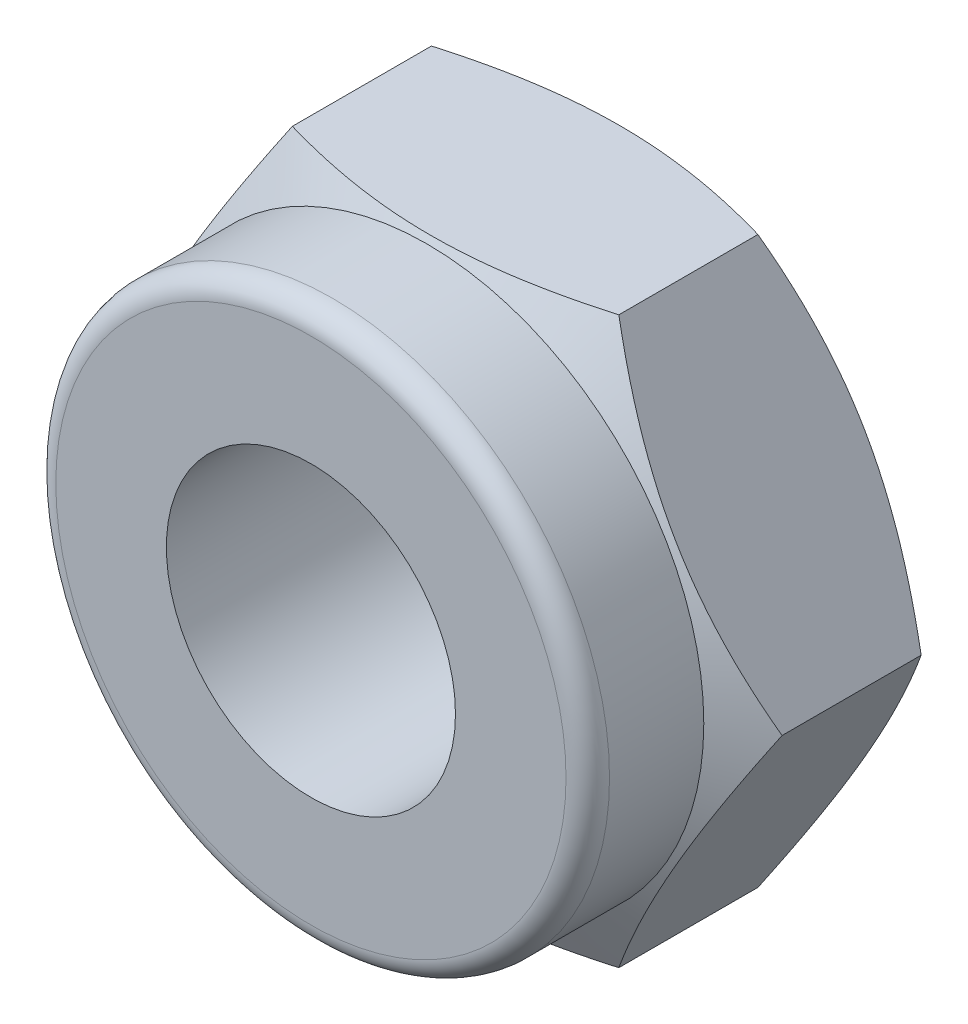
ISO-10303-21;
HEADER;
FILE_DESCRIPTION(('STEP AP214'),'2;1');
FILE_NAME('part.step','',(''),(''),'','','');
FILE_SCHEMA(('AUTOMOTIVE_DESIGN { 1 0 10303 214 1 1 1 1 }'));
ENDSEC;
DATA;
#1=APPLICATION_CONTEXT('core data for automotive mechanical design processes');
#2=APPLICATION_PROTOCOL_DEFINITION('international standard','automotive_design',2000,#1);
#3=PRODUCT_CONTEXT('',#1,'mechanical');
#4=PRODUCT('Part','Part','',(#3));
#5=PRODUCT_RELATED_PRODUCT_CATEGORY('part','',(#4));
#6=PRODUCT_DEFINITION_FORMATION('','',#4);
#7=PRODUCT_DEFINITION_CONTEXT('part definition',#1,'design');
#8=PRODUCT_DEFINITION('design','',#6,#7);
#9=PRODUCT_DEFINITION_SHAPE('','',#8);
#10=(LENGTH_UNIT() NAMED_UNIT(*) SI_UNIT(.MILLI.,.METRE.));
#11=(NAMED_UNIT(*) PLANE_ANGLE_UNIT() SI_UNIT($,.RADIAN.));
#12=(NAMED_UNIT(*) SI_UNIT($,.STERADIAN.) SOLID_ANGLE_UNIT());
#13=UNCERTAINTY_MEASURE_WITH_UNIT(LENGTH_MEASURE(1.E-05),#10,'distance_accuracy_value','');
#14=(GEOMETRIC_REPRESENTATION_CONTEXT(3) GLOBAL_UNCERTAINTY_ASSIGNED_CONTEXT((#13)) GLOBAL_UNIT_ASSIGNED_CONTEXT((#10,
#11,#12)) REPRESENTATION_CONTEXT('',''));
#15=CARTESIAN_POINT('',(0.,0.,0.));
#16=DIRECTION('',(0.,0.,1.));
#17=DIRECTION('',(1.,0.,0.));
#18=AXIS2_PLACEMENT_3D('',#15,#16,#17);
#19=CARTESIAN_POINT('',(0.,0.,4.35));
#20=DIRECTION('',(0.,0.,-1.));
#21=DIRECTION('',(-1.,0.,0.));
#22=AXIS2_PLACEMENT_3D('',#19,#20,#21);
#23=CYLINDRICAL_SURFACE('',#22,6.365);
#24=CARTESIAN_POINT('',(0.,0.,1.85));
#25=DIRECTION('',(0.,0.,1.));
#26=DIRECTION('',(1.,0.,0.));
#27=AXIS2_PLACEMENT_3D('',#24,#25,#26);
#28=CIRCLE('',#27,6.365);
#29=CARTESIAN_POINT('',(6.365,0.,1.85));
#30=VERTEX_POINT('',#29);
#31=EDGE_CURVE('E195',#30,#30,#28,.T.);
#32=ORIENTED_EDGE('',*,*,#31,.F.);
#33=EDGE_LOOP('',(#32));
#34=FACE_BOUND('',#33,.T.);
#35=CARTESIAN_POINT('',(0.,0.,-0.317542648054294));
#36=DIRECTION('',(0.,0.,-1.));
#37=DIRECTION('',(1.,0.,0.));
#38=AXIS2_PLACEMENT_3D('',#35,#36,#37);
#39=CIRCLE('',#38,6.365);
#40=CARTESIAN_POINT('',(6.365,0.,-0.317542648054294));
#41=VERTEX_POINT('',#40);
#42=EDGE_CURVE('E198',#41,#41,#39,.T.);
#43=ORIENTED_EDGE('',*,*,#42,.F.);
#44=EDGE_LOOP('',(#43));
#45=FACE_BOUND('',#44,.T.);
#46=ADVANCED_FACE('F17',(#34,#45),#23,.T.);
#47=CARTESIAN_POINT('',(0.,0.,1.85));
#48=DIRECTION('',(0.,0.,1.));
#49=DIRECTION('',(1.,0.,0.));
#50=AXIS2_PLACEMENT_3D('',#47,#48,#49);
#51=TOROIDAL_SURFACE('',#50,5.865,0.5);
#52=ORIENTED_EDGE('',*,*,#31,.T.);
#53=EDGE_LOOP('',(#52));
#54=FACE_BOUND('',#53,.T.);
#55=CARTESIAN_POINT('',(0.,0.,2.35));
#56=DIRECTION('',(0.,0.,-1.));
#57=DIRECTION('',(1.,0.,0.));
#58=AXIS2_PLACEMENT_3D('',#55,#56,#57);
#59=CIRCLE('',#58,5.865);
#60=CARTESIAN_POINT('',(-5.865,0.,2.35));
#61=VERTEX_POINT('',#60);
#62=CARTESIAN_POINT('',(5.865,0.,2.35));
#63=VERTEX_POINT('',#62);
#64=EDGE_CURVE('E75',#61,#63,#59,.F.);
#65=ORIENTED_EDGE('',*,*,#64,.F.);
#66=CARTESIAN_POINT('',(0.,0.,2.35));
#67=DIRECTION('',(0.,0.,-1.));
#68=DIRECTION('',(-1.,0.,0.));
#69=AXIS2_PLACEMENT_3D('',#66,#67,#68);
#70=CIRCLE('',#69,5.865);
#71=EDGE_CURVE('E201',#63,#61,#70,.F.);
#72=ORIENTED_EDGE('',*,*,#71,.F.);
#73=EDGE_LOOP('',(#65,#72));
#74=FACE_BOUND('',#73,.T.);
#75=ADVANCED_FACE('F110',(#54,#74),#51,.T.);
#76=CARTESIAN_POINT('',(0.,0.,-0.97999251121531));
#77=DIRECTION('',(0.,0.,-1.));
#78=DIRECTION('',(-1.,0.,0.));
#79=AXIS2_PLACEMENT_3D('',#76,#77,#78);
#80=CONICAL_SURFACE('',#79,7.51239682046193,1.0471975511966);
#81=CARTESIAN_POINT('',(7.50555349946514,0.,-0.976041517995662));
#82=CARTESIAN_POINT('',(7.42306413225731,-0.142875775088176,-0.928425447547227));
#83=CARTESIAN_POINT('',(7.34026720585395,-0.286284258329331,-0.882970550055043));
#84=CARTESIAN_POINT('',(7.17400096468323,-0.574265835620523,-0.796978304075957));
#85=CARTESIAN_POINT('',(7.09053137629194,-0.718839403601101,-0.756443076940983));
#86=CARTESIAN_POINT('',(6.83878625276799,-1.15487474810228,-0.643012619628592));
#87=CARTESIAN_POINT('',(6.66951702604567,-1.44805764894324,-0.578495682867198));
#88=CARTESIAN_POINT('',(6.41620872846852,-1.88680049032564,-0.502843782974544));
#89=CARTESIAN_POINT('',(6.33292644227507,-2.03104964138317,-0.48129310542054));
#90=CARTESIAN_POINT('',(6.16598561364301,-2.32019963843156,-0.445156633633839));
#91=CARTESIAN_POINT('',(6.08232710510691,-2.46510042570152,-0.430570224040223));
#92=CARTESIAN_POINT('',(5.91486483881928,-2.75515357926232,-0.408734025939752));
#93=CARTESIAN_POINT('',(5.83106135447214,-2.90030547200287,-0.401475912268133));
#94=CARTESIAN_POINT('',(5.66338165892069,-3.19073522409566,-0.394444145267347));
#95=CARTESIAN_POINT('',(5.57950545004408,-3.33601307941621,-0.394670260634795));
#96=CARTESIAN_POINT('',(5.34972638911939,-3.73400208745323,-0.405576488157031));
#97=CARTESIAN_POINT('',(5.20389879784904,-3.98658288467888,-0.423875958247116));
#98=CARTESIAN_POINT('',(4.91321216353889,-4.49006690438526,-0.481897477157326));
#99=CARTESIAN_POINT('',(4.76835414237743,-4.74096835692078,-0.521639346886367));
#100=CARTESIAN_POINT('',(4.47708276744823,-5.24546517708861,-0.620980029139186));
#101=CARTESIAN_POINT('',(4.33070615631823,-5.49899690460551,-0.680999630839513));
#102=CARTESIAN_POINT('',(4.04013550251678,-6.00228004017814,-0.817218966611441));
#103=CARTESIAN_POINT('',(3.89593774018532,-6.25203789087397,-0.893386714735364));
#104=CARTESIAN_POINT('',(3.75277674973258,-6.5,-0.976041517995661));
#105=B_SPLINE_CURVE_WITH_KNOTS('',3,(#81,#82,#83,#84,#85,#86,#87,#88,#89,#90,#91,#92,#93,#94,
#95,#96,#97,#98,#99,#100,#101,#102,#103,#104),.UNSPECIFIED.,.F.,.F.,(4,2,2,2,2,2,2,2,2,2,2,4),
(0.,0.515097151807923,1.03041562924707,2.0631934970254,2.56693469263121,3.07063136955385,
3.57375518587235,4.07686345294286,4.95263085757859,5.82920919385675,6.72522583711309,
7.61948397794854),.UNSPECIFIED.);
#106=CARTESIAN_POINT('',(7.50555349946513,0.,-0.976041517995657));
#107=VERTEX_POINT('',#106);
#108=CARTESIAN_POINT('',(3.75277674973258,-6.5,-0.976041517995662));
#109=VERTEX_POINT('',#108);
#110=EDGE_CURVE('E64',#107,#109,#105,.T.);
#111=ORIENTED_EDGE('',*,*,#110,.F.);
#112=CARTESIAN_POINT('',(3.75277674973256,6.5,-0.976041517995656));
#113=CARTESIAN_POINT('',(3.83526611694039,6.35712422491183,-0.928425447547222));
#114=CARTESIAN_POINT('',(3.91806304334374,6.21371574167068,-0.882970550055038));
#115=CARTESIAN_POINT('',(4.08432928451447,5.92573416437948,-0.796978304075951));
#116=CARTESIAN_POINT('',(4.16779887290576,5.78116059639891,-0.756443076940976));
#117=CARTESIAN_POINT('',(4.4195439964297,5.34512525189773,-0.643012619628585));
#118=CARTESIAN_POINT('',(4.58881322315202,5.05194235105677,-0.57849568286719));
#119=CARTESIAN_POINT('',(4.84212152072918,4.61319950967437,-0.502843782974536));
#120=CARTESIAN_POINT('',(4.92540380692262,4.46895035861684,-0.481293105420532));
#121=CARTESIAN_POINT('',(5.09234463555468,4.17980036156845,-0.445156633633831));
#122=CARTESIAN_POINT('',(5.17600314409078,4.03489957429849,-0.430570224040214));
#123=CARTESIAN_POINT('',(5.34346541037841,3.74484642073769,-0.408734025939743));
#124=CARTESIAN_POINT('',(5.42726889472555,3.59969452799714,-0.401475912268124));
#125=CARTESIAN_POINT('',(5.594948590277,3.30926477590435,-0.394444145267338));
#126=CARTESIAN_POINT('',(5.67882479915361,3.16398692058381,-0.394670260634785));
#127=CARTESIAN_POINT('',(5.9086038600783,2.76599791254678,-0.40557648815702));
#128=CARTESIAN_POINT('',(6.05443145134866,2.51341711532113,-0.423875958247104));
#129=CARTESIAN_POINT('',(6.34511808565881,2.00993309561475,-0.481897477157315));
#130=CARTESIAN_POINT('',(6.48997610682026,1.75903164307923,-0.521639346886356));
#131=CARTESIAN_POINT('',(6.78124748174947,1.25453482291139,-0.620980029139175));
#132=CARTESIAN_POINT('',(6.92762409287947,1.00100309539449,-0.680999630839503));
#133=CARTESIAN_POINT('',(7.21819474668093,0.497719959821852,-0.817218966611432));
#134=CARTESIAN_POINT('',(7.36239250901238,0.247962109126026,-0.893386714735356));
#135=CARTESIAN_POINT('',(7.50555349946513,0.,-0.976041517995654));
#136=B_SPLINE_CURVE_WITH_KNOTS('',3,(#112,#113,#114,#115,#116,#117,#118,#119,#120,#121,#122,
#123,#124,#125,#126,#127,#128,#129,#130,#131,#132,#133,#134,#135),.UNSPECIFIED.,.F.,.F.,(4,2,2,
2,2,2,2,2,2,2,2,4),(0.,0.515097151807923,1.03041562924707,2.06319349702539,2.5669346926312,
3.07063136955385,3.57375518587234,4.07686345294285,4.95263085757859,5.82920919385676,
6.72522583711311,7.61948397794856),.UNSPECIFIED.);
#137=CARTESIAN_POINT('',(3.75277674973256,6.5,-0.976041517995657));
#138=VERTEX_POINT('',#137);
#139=EDGE_CURVE('E69',#138,#107,#136,.T.);
#140=ORIENTED_EDGE('',*,*,#139,.F.);
#141=CARTESIAN_POINT('',(-3.75277674973256,6.5,-0.976041517995659));
#142=CARTESIAN_POINT('',(-3.5877980153169,6.5,-0.928425447547224));
#143=CARTESIAN_POINT('',(-3.42220416251019,6.5,-0.882970550055041));
#144=CARTESIAN_POINT('',(-3.08967168016874,6.5,-0.796978304075955));
#145=CARTESIAN_POINT('',(-2.92273250338616,6.5,-0.75644307694098));
#146=CARTESIAN_POINT('',(-2.41924225633827,6.5,-0.64301261962859));
#147=CARTESIAN_POINT('',(-2.08070380289362,6.5,-0.578495682867194));
#148=CARTESIAN_POINT('',(-1.57408720773932,6.5,-0.502843782974541));
#149=CARTESIAN_POINT('',(-1.40752263535244,6.5,-0.481293105420537));
#150=CARTESIAN_POINT('',(-1.07364097808831,6.5,-0.445156633633837));
#151=CARTESIAN_POINT('',(-0.906323961016103,6.5,-0.43057022404022));
#152=CARTESIAN_POINT('',(-0.57139942844085,6.5,-0.408734025939749));
#153=CARTESIAN_POINT('',(-0.40379245974657,6.5,-0.40147591226813));
#154=CARTESIAN_POINT('',(-0.0684330686436741,6.5,-0.394444145267344));
#155=CARTESIAN_POINT('',(0.0993193491095459,6.5,-0.394670260634792));
#156=CARTESIAN_POINT('',(0.558877470958923,6.5,-0.405576488157028));
#157=CARTESIAN_POINT('',(0.850532653499638,6.5,-0.423875958247112));
#158=CARTESIAN_POINT('',(1.43190592211994,6.5,-0.481897477157322));
#159=CARTESIAN_POINT('',(1.72162196444284,6.5,-0.521639346886363));
#160=CARTESIAN_POINT('',(2.30416471430125,6.5,-0.620980029139182));
#161=CARTESIAN_POINT('',(2.59691793656125,6.5,-0.680999630839509));
#162=CARTESIAN_POINT('',(3.17805924416416,6.5,-0.817218966611437));
#163=CARTESIAN_POINT('',(3.46645476882707,6.5,-0.89338671473536));
#164=CARTESIAN_POINT('',(3.75277674973256,6.5,-0.976041517995657));
#165=B_SPLINE_CURVE_WITH_KNOTS('',3,(#141,#142,#143,#144,#145,#146,#147,#148,#149,#150,#151,
#152,#153,#154,#155,#156,#157,#158,#159,#160,#161,#162,#163,#164),.UNSPECIFIED.,.F.,.F.,(4,2,2,
2,2,2,2,2,2,2,2,4),(0.,0.515097151807923,1.03041562924707,2.06319349702539,2.56693469263121,
3.07063136955385,3.57375518587235,4.07686345294286,4.95263085757859,5.82920919385675,
6.72522583711309,7.61948397794854),.UNSPECIFIED.);
#166=CARTESIAN_POINT('',(-3.75277674973256,6.5,-0.976041517995659));
#167=VERTEX_POINT('',#166);
#168=EDGE_CURVE('E87',#167,#138,#165,.T.);
#169=ORIENTED_EDGE('',*,*,#168,.F.);
#170=CARTESIAN_POINT('',(-7.50555349946513,0.,-0.976041517995657));
#171=CARTESIAN_POINT('',(-7.4230641322573,0.14287577508817,-0.928425447547223));
#172=CARTESIAN_POINT('',(-7.34026720585394,0.286284258329325,-0.882970550055039));
#173=CARTESIAN_POINT('',(-7.17400096468322,0.574265835620517,-0.796978304075953));
#174=CARTESIAN_POINT('',(-7.09053137629193,0.718839403601094,-0.756443076940978));
#175=CARTESIAN_POINT('',(-6.83878625276799,1.15487474810227,-0.643012619628588));
#176=CARTESIAN_POINT('',(-6.66951702604566,1.44805764894323,-0.578495682867193));
#177=CARTESIAN_POINT('',(-6.41620872846851,1.88680049032563,-0.502843782974539));
#178=CARTESIAN_POINT('',(-6.33292644227507,2.03104964138316,-0.481293105420536));
#179=CARTESIAN_POINT('',(-6.165985613643,2.32019963843155,-0.445156633633835));
#180=CARTESIAN_POINT('',(-6.0823271051069,2.46510042570151,-0.430570224040218));
#181=CARTESIAN_POINT('',(-5.91486483881928,2.75515357926231,-0.408734025939748));
#182=CARTESIAN_POINT('',(-5.83106135447214,2.90030547200286,-0.401475912268128));
#183=CARTESIAN_POINT('',(-5.66338165892069,3.19073522409565,-0.394444145267342));
#184=CARTESIAN_POINT('',(-5.57950545004408,3.3360130794162,-0.394670260634789));
#185=CARTESIAN_POINT('',(-5.34972638911939,3.73400208745322,-0.405576488157025));
#186=CARTESIAN_POINT('',(-5.20389879784903,3.98658288467887,-0.42387595824711));
#187=CARTESIAN_POINT('',(-4.91321216353888,4.49006690438525,-0.481897477157321));
#188=CARTESIAN_POINT('',(-4.76835414237743,4.74096835692077,-0.521639346886362));
#189=CARTESIAN_POINT('',(-4.47708276744822,5.2454651770886,-0.620980029139181));
#190=CARTESIAN_POINT('',(-4.33070615631822,5.49899690460551,-0.680999630839509));
#191=CARTESIAN_POINT('',(-4.04013550251676,6.00228004017814,-0.817218966611438));
#192=CARTESIAN_POINT('',(-3.89593774018531,6.25203789087397,-0.893386714735362));
#193=CARTESIAN_POINT('',(-3.75277674973256,6.5,-0.976041517995659));
#194=B_SPLINE_CURVE_WITH_KNOTS('',3,(#170,#171,#172,#173,#174,#175,#176,#177,#178,#179,#180,
#181,#182,#183,#184,#185,#186,#187,#188,#189,#190,#191,#192,#193),.UNSPECIFIED.,.F.,.F.,(4,2,2,
2,2,2,2,2,2,2,2,4),(0.,0.515097151807923,1.03041562924707,2.06319349702539,2.56693469263121,
3.07063136955385,3.57375518587235,4.07686345294286,4.95263085757859,5.82920919385676,
6.7252258371131,7.61948397794855),.UNSPECIFIED.);
#195=CARTESIAN_POINT('',(-7.50555349946513,0.,-0.976041517995656));
#196=VERTEX_POINT('',#195);
#197=EDGE_CURVE('E244',#196,#167,#194,.T.);
#198=ORIENTED_EDGE('',*,*,#197,.F.);
#199=CARTESIAN_POINT('',(-3.75277674973256,-6.5,-0.976041517995658));
#200=CARTESIAN_POINT('',(-3.83526611694039,-6.35712422491183,-0.928425447547224));
#201=CARTESIAN_POINT('',(-3.91806304334374,-6.21371574167068,-0.88297055005504));
#202=CARTESIAN_POINT('',(-4.08432928451447,-5.92573416437949,-0.796978304075952));
#203=CARTESIAN_POINT('',(-4.16779887290576,-5.78116059639891,-0.756443076940977));
#204=CARTESIAN_POINT('',(-4.4195439964297,-5.34512525189773,-0.643012619628585));
#205=CARTESIAN_POINT('',(-4.58881322315203,-5.05194235105677,-0.578495682867191));
#206=CARTESIAN_POINT('',(-4.84212152072918,-4.61319950967437,-0.502843782974538));
#207=CARTESIAN_POINT('',(-4.92540380692262,-4.46895035861684,-0.481293105420534));
#208=CARTESIAN_POINT('',(-5.09234463555468,-4.17980036156845,-0.445156633633833));
#209=CARTESIAN_POINT('',(-5.17600314409079,-4.03489957429849,-0.430570224040216));
#210=CARTESIAN_POINT('',(-5.34346541037841,-3.74484642073769,-0.408734025939745));
#211=CARTESIAN_POINT('',(-5.42726889472555,-3.59969452799714,-0.401475912268125));
#212=CARTESIAN_POINT('',(-5.594948590277,-3.30926477590435,-0.394444145267339));
#213=CARTESIAN_POINT('',(-5.67882479915361,-3.1639869205838,-0.394670260634786));
#214=CARTESIAN_POINT('',(-5.9086038600783,-2.76599791254678,-0.405576488157022));
#215=CARTESIAN_POINT('',(-6.05443145134866,-2.51341711532113,-0.423875958247106));
#216=CARTESIAN_POINT('',(-6.34511808565881,-2.00993309561475,-0.481897477157316));
#217=CARTESIAN_POINT('',(-6.48997610682026,-1.75903164307923,-0.521639346886357));
#218=CARTESIAN_POINT('',(-6.78124748174947,-1.2545348229114,-0.620980029139176));
#219=CARTESIAN_POINT('',(-6.92762409287947,-1.00100309539449,-0.680999630839504));
#220=CARTESIAN_POINT('',(-7.21819474668093,-0.497719959821857,-0.817218966611433));
#221=CARTESIAN_POINT('',(-7.36239250901238,-0.247962109126032,-0.893386714735357));
#222=CARTESIAN_POINT('',(-7.50555349946513,0.,-0.976041517995654));
#223=B_SPLINE_CURVE_WITH_KNOTS('',3,(#199,#200,#201,#202,#203,#204,#205,#206,#207,#208,#209,
#210,#211,#212,#213,#214,#215,#216,#217,#218,#219,#220,#221,#222),.UNSPECIFIED.,.F.,.F.,(4,2,2,
2,2,2,2,2,2,2,2,4),(0.,0.515097151807923,1.03041562924707,2.06319349702539,2.56693469263121,
3.07063136955385,3.57375518587235,4.07686345294285,4.95263085757859,5.82920919385676,
6.7252258371131,7.61948397794856),.UNSPECIFIED.);
#224=CARTESIAN_POINT('',(-3.75277674973256,-6.5,-0.976041517995657));
#225=VERTEX_POINT('',#224);
#226=EDGE_CURVE('E120',#225,#196,#223,.T.);
#227=ORIENTED_EDGE('',*,*,#226,.F.);
#228=CARTESIAN_POINT('',(3.75277674973257,-6.5,-0.976041517995663));
#229=CARTESIAN_POINT('',(3.58779801531691,-6.5,-0.928425447547228));
#230=CARTESIAN_POINT('',(3.4222041625102,-6.5,-0.882970550055044));
#231=CARTESIAN_POINT('',(3.08967168016875,-6.5,-0.796978304075957));
#232=CARTESIAN_POINT('',(2.92273250338617,-6.5,-0.756443076940983));
#233=CARTESIAN_POINT('',(2.41924225633828,-6.5,-0.643012619628591));
#234=CARTESIAN_POINT('',(2.08070380289363,-6.5,-0.578495682867196));
#235=CARTESIAN_POINT('',(1.57408720773933,-6.5,-0.502843782974542));
#236=CARTESIAN_POINT('',(1.40752263535245,-6.5,-0.481293105420539));
#237=CARTESIAN_POINT('',(1.07364097808832,-6.5,-0.445156633633838));
#238=CARTESIAN_POINT('',(0.906323961016112,-6.5,-0.430570224040221));
#239=CARTESIAN_POINT('',(0.571399428440859,-6.5,-0.40873402593975));
#240=CARTESIAN_POINT('',(0.403792459746578,-6.5,-0.40147591226813));
#241=CARTESIAN_POINT('',(0.0684330686436822,-6.5,-0.394444145267344));
#242=CARTESIAN_POINT('',(-0.0993193491095378,-6.5,-0.394670260634792));
#243=CARTESIAN_POINT('',(-0.558877470958916,-6.5,-0.405576488157028));
#244=CARTESIAN_POINT('',(-0.850532653499632,-6.5,-0.423875958247112));
#245=CARTESIAN_POINT('',(-1.43190592211993,-6.5,-0.481897477157322));
#246=CARTESIAN_POINT('',(-1.72162196444284,-6.5,-0.521639346886363));
#247=CARTESIAN_POINT('',(-2.30416471430125,-6.5,-0.620980029139181));
#248=CARTESIAN_POINT('',(-2.59691793656124,-6.5,-0.680999630839508));
#249=CARTESIAN_POINT('',(-3.17805924416416,-6.5,-0.817218966611435));
#250=CARTESIAN_POINT('',(-3.46645476882707,-6.5,-0.893386714735359));
#251=CARTESIAN_POINT('',(-3.75277674973256,-6.5,-0.976041517995657));
#252=B_SPLINE_CURVE_WITH_KNOTS('',3,(#228,#229,#230,#231,#232,#233,#234,#235,#236,#237,#238,
#239,#240,#241,#242,#243,#244,#245,#246,#247,#248,#249,#250,#251),.UNSPECIFIED.,.F.,.F.,(4,2,2,
2,2,2,2,2,2,2,2,4),(0.,0.515097151807923,1.03041562924707,2.0631934970254,2.56693469263121,
3.07063136955385,3.57375518587235,4.07686345294286,4.95263085757859,5.82920919385676,
6.7252258371131,7.61948397794855),.UNSPECIFIED.);
#253=EDGE_CURVE('E72',#109,#225,#252,.T.);
#254=ORIENTED_EDGE('',*,*,#253,.F.);
#255=EDGE_LOOP('',(#111,#140,#169,#198,#227,#254));
#256=FACE_BOUND('',#255,.T.);
#257=ORIENTED_EDGE('',*,*,#42,.T.);
#258=EDGE_LOOP('',(#257));
#259=FACE_BOUND('',#258,.T.);
#260=ADVANCED_FACE('F65',(#256,#259),#80,.T.);
#261=CARTESIAN_POINT('',(0.,0.,2.35));
#262=DIRECTION('',(0.,0.,1.));
#263=DIRECTION('',(1.,0.,0.));
#264=AXIS2_PLACEMENT_3D('',#261,#262,#263);
#265=PLANE('',#264);
#266=CARTESIAN_POINT('',(0.,0.,2.35));
#267=DIRECTION('',(0.,0.,1.));
#268=DIRECTION('',(1.,0.,0.));
#269=AXIS2_PLACEMENT_3D('',#266,#267,#268);
#270=CIRCLE('',#269,3.3235);
#271=CARTESIAN_POINT('',(3.3235,0.,2.35));
#272=VERTEX_POINT('',#271);
#273=EDGE_CURVE('E82',#272,#272,#270,.F.);
#274=ORIENTED_EDGE('',*,*,#273,.T.);
#275=EDGE_LOOP('',(#274));
#276=FACE_BOUND('',#275,.T.);
#277=ORIENTED_EDGE('',*,*,#71,.T.);
#278=ORIENTED_EDGE('',*,*,#64,.T.);
#279=EDGE_LOOP('',(#277,#278));
#280=FACE_BOUND('',#279,.T.);
#281=ADVANCED_FACE('F109',(#276,#280),#265,.T.);
#282=CARTESIAN_POINT('',(3.75277674973258,-6.5,-5.15));
#283=DIRECTION('',(0.866025403784439,-0.5,0.));
#284=DIRECTION('',(0.5,0.866025403784439,0.));
#285=AXIS2_PLACEMENT_3D('',#282,#283,#284);
#286=PLANE('',#285);
#287=DIRECTION('',(0.,0.,-1.));
#288=VECTOR('',#287,1.);
#289=CARTESIAN_POINT('',(3.75277674973258,-6.5,-5.15));
#290=LINE('',#289,#288);
#291=CARTESIAN_POINT('',(3.75277676639756,-6.5,-4.17395847719851));
#292=VERTEX_POINT('',#291);
#293=EDGE_CURVE('E74',#292,#109,#290,.F.);
#294=ORIENTED_EDGE('',*,*,#293,.F.);
#295=CARTESIAN_POINT('',(7.5055534994611,-7.00308469126436E-12,-4.17395848201161));
#296=CARTESIAN_POINT('',(7.42306413226044,-0.142875775082739,-4.22157455245497));
#297=CARTESIAN_POINT('',(7.34026720586433,-0.286284258311354,-4.26702944994249));
#298=CARTESIAN_POINT('',(7.17400096470823,-0.574265835577209,-4.35302169591321));
#299=CARTESIAN_POINT('',(7.09053137632433,-0.71883940354499,-4.39355692304449));
#300=CARTESIAN_POINT('',(6.83878625282459,-1.15487474800424,-4.50698738034673));
#301=CARTESIAN_POINT('',(6.66951702611933,-1.44805764881566,-4.57150431710366));
#302=CARTESIAN_POINT('',(6.4162087285524,-1.88680049018035,-4.64715621699928));
#303=CARTESIAN_POINT('',(6.33292644235192,-2.03104964125008,-4.66870689455695));
#304=CARTESIAN_POINT('',(6.16598561370569,-2.320199638323,-4.70484336634996));
#305=CARTESIAN_POINT('',(6.08232710516246,-2.46510042560531,-4.71942977594624));
#306=CARTESIAN_POINT('',(5.91486483885972,-2.75515357919228,-4.7412659740512));
#307=CARTESIAN_POINT('',(5.83106135450459,-2.90030547194666,-4.74852408772457));
#308=CARTESIAN_POINT('',(5.66338165893724,-3.190735224067,-4.75555585472706));
#309=CARTESIAN_POINT('',(5.57950545005271,-3.33601307940126,-4.75532973935959));
#310=CARTESIAN_POINT('',(5.34972639277594,-3.73400208111991,-4.74442351201218));
#311=CARTESIAN_POINT('',(5.20389880515664,-3.98658287202175,-4.72612404266922));
#312=CARTESIAN_POINT('',(4.91321217808701,-4.49006687918717,-4.66810252628159));
#313=CARTESIAN_POINT('',(4.76835416051488,-4.7409683255058,-4.62836065833044));
#314=CARTESIAN_POINT('',(4.47708279284768,-5.24546513309547,-4.52901998051057));
#315=CARTESIAN_POINT('',(4.33070618538681,-5.49899685425726,-4.4690003814974));
#316=CARTESIAN_POINT('',(4.04013553879003,-6.00227997735102,-4.33278105168422));
#317=CARTESIAN_POINT('',(3.89593777999461,-6.25203782192225,-4.25661330682833));
#318=CARTESIAN_POINT('',(3.75277679302817,-6.49999992500984,-4.173958507006));
#319=B_SPLINE_CURVE_WITH_KNOTS('',3,(#295,#296,#297,#298,#299,#300,#301,#302,#303,#304,#305,
#306,#307,#308,#309,#310,#311,#312,#313,#314,#315,#316,#317,#318),.UNSPECIFIED.,.F.,.F.,(4,2,2,
2,2,2,2,2,2,2,2,4),(0.,0.515097151762339,1.03041562915581,2.06319349683153,2.56693469248062,
3.07063136944647,3.5737551858133,4.07686345293021,4.95263083563277,5.82920914989659,
6.72522576999469,7.6194838878483),.UNSPECIFIED.);
#320=CARTESIAN_POINT('',(7.50555349949747,0.,-4.17395848200038));
#321=VERTEX_POINT('',#320);
#322=EDGE_CURVE('E36',#321,#292,#319,.T.);
#323=ORIENTED_EDGE('',*,*,#322,.F.);
#324=DIRECTION('',(0.,0.,1.));
#325=VECTOR('',#324,1.);
#326=CARTESIAN_POINT('',(7.50555349946513,0.,-5.15));
#327=LINE('',#326,#325);
#328=EDGE_CURVE('E77',#107,#321,#327,.F.);
#329=ORIENTED_EDGE('',*,*,#328,.F.);
#330=ORIENTED_EDGE('',*,*,#110,.T.);
#331=EDGE_LOOP('',(#294,#323,#329,#330));
#332=FACE_BOUND('',#331,.T.);
#333=ADVANCED_FACE('F78',(#332),#286,.T.);
#334=CARTESIAN_POINT('',(-3.75277674973256,-6.5,-5.15));
#335=DIRECTION('',(0.,-1.,0.));
#336=DIRECTION('',(0.,0.,-1.));
#337=AXIS2_PLACEMENT_3D('',#334,#335,#336);
#338=PLANE('',#337);
#339=DIRECTION('',(0.,0.,1.));
#340=VECTOR('',#339,1.);
#341=CARTESIAN_POINT('',(-3.75277674973256,-6.5,-5.15));
#342=LINE('',#341,#340);
#343=CARTESIAN_POINT('',(-3.75277674139978,-6.5000000144328,-4.17395847719835));
#344=VERTEX_POINT('',#343);
#345=EDGE_CURVE('E137',#344,#225,#342,.T.);
#346=ORIENTED_EDGE('',*,*,#345,.F.);
#347=CARTESIAN_POINT('',(3.75277678306254,-6.5,-4.17395847238775));
#348=CARTESIAN_POINT('',(3.58779804838594,-6.5,-4.22157454322773));
#349=CARTESIAN_POINT('',(3.42220419531707,-6.5,-4.26702944112164));
#350=CARTESIAN_POINT('',(3.08967171244588,-6.5,-4.3530216879232));
#351=CARTESIAN_POINT('',(2.92273253539569,-6.5,-4.39355691547892));
#352=CARTESIAN_POINT('',(2.41924228751765,-6.5,-4.5069873740845));
#353=CARTESIAN_POINT('',(2.08070383349787,-6.5,-4.57150431174356));
#354=CARTESIAN_POINT('',(1.57408723743433,-6.5,-4.64715621298692));
#355=CARTESIAN_POINT('',(1.40752266473778,-6.5,-4.6687068909864));
#356=CARTESIAN_POINT('',(1.07364100683674,-6.5,-4.70484336365841));
#357=CARTESIAN_POINT('',(0.906323989437311,-6.5,-4.71942977369187));
#358=CARTESIAN_POINT('',(0.571399456190159,-6.5,-4.74126597265532));
#359=CARTESIAN_POINT('',(0.403792487151232,-6.5,-4.74852408675015));
#360=CARTESIAN_POINT('',(0.0684330953407197,-6.5,-4.75555585456964));
#361=CARTESIAN_POINT('',(-0.0993193227754698,-6.5,-4.75532973959772));
#362=CARTESIAN_POINT('',(-0.558877439803717,-6.5,-4.74442351324807));
#363=CARTESIAN_POINT('',(-0.850532617185107,-6.5,-4.72612404435291));
#364=CARTESIAN_POINT('',(-1.43190587561644,-6.5,-4.66810252850229));
#365=CARTESIAN_POINT('',(-1.72162191290994,-6.5,-4.62836066063956));
#366=CARTESIAN_POINT('',(-2.30416465261939,-6.5,-4.5290199826661));
#367=CARTESIAN_POINT('',(-2.59691786976532,-6.5,-4.46900038339938));
#368=CARTESIAN_POINT('',(-3.17805916733875,-6.5,-4.33278105281471));
#369=CARTESIAN_POINT('',(-3.46645468708551,-6.5,-4.25661330744193));
#370=CARTESIAN_POINT('',(-3.75277666314028,-6.5,-4.17395850700632));
#371=B_SPLINE_CURVE_WITH_KNOTS('',3,(#347,#348,#349,#350,#351,#352,#353,#354,#355,#356,#357,
#358,#359,#360,#361,#362,#363,#364,#365,#366,#367,#368,#369,#370),.UNSPECIFIED.,.F.,.F.,(4,2,2,
2,2,2,2,2,2,2,2,4),(0.,0.515097152885971,1.03041563140371,2.06319350138647,2.56693469808512,
3.07063137610016,3.57375519350606,4.07686346166217,4.95263085067335,5.82920917127014,
6.72522579804451,7.61948392253173),.UNSPECIFIED.);
#372=EDGE_CURVE('E148',#292,#344,#371,.T.);
#373=ORIENTED_EDGE('',*,*,#372,.F.);
#374=ORIENTED_EDGE('',*,*,#293,.T.);
#375=ORIENTED_EDGE('',*,*,#253,.T.);
#376=EDGE_LOOP('',(#346,#373,#374,#375));
#377=FACE_BOUND('',#376,.T.);
#378=ADVANCED_FACE('F138',(#377),#338,.T.);
#379=CARTESIAN_POINT('',(-7.50555349946513,0.,-5.15));
#380=DIRECTION('',(-0.866025403784439,-0.5,0.));
#381=DIRECTION('',(0.5,-0.866025403784439,0.));
#382=AXIS2_PLACEMENT_3D('',#379,#380,#381);
#383=PLANE('',#382);
#384=DIRECTION('',(0.,0.,1.));
#385=VECTOR('',#384,1.);
#386=CARTESIAN_POINT('',(-7.50555349946513,0.,-5.15));
#387=LINE('',#386,#385);
#388=CARTESIAN_POINT('',(-7.50555349943801,0.,-4.17395848203379));
#389=VERTEX_POINT('',#388);
#390=EDGE_CURVE('E241',#389,#196,#387,.T.);
#391=ORIENTED_EDGE('',*,*,#390,.F.);
#392=CARTESIAN_POINT('',(-3.752776733067,-6.5000000288656,-4.17395847238742));
#393=CARTESIAN_POINT('',(-3.83526610041231,-6.3571242535393,-4.22157454323146));
#394=CARTESIAN_POINT('',(-3.91806302695381,-6.21371577005887,-4.26702944112906));
#395=CARTESIAN_POINT('',(-4.08432926840367,-5.9257341922842,-4.35302168793712));
#396=CARTESIAN_POINT('',(-4.16779885693595,-5.78116062405942,-4.39355691549566));
#397=CARTESIAN_POINT('',(-4.41954398089852,-5.34512527879852,-4.5069873741089));
#398=CARTESIAN_POINT('',(-4.58881320792497,-5.0519423774308,-4.57150431177098));
#399=CARTESIAN_POINT('',(-4.84212150596625,-4.61319953524451,-4.64715621300974));
#400=CARTESIAN_POINT('',(-4.9254037923073,-4.46895038393132,-4.6687068910051));
#401=CARTESIAN_POINT('',(-5.09234462124325,-4.17980038635659,-4.70484336367005));
#402=CARTESIAN_POINT('',(-5.17600312993563,-4.03489959881594,-4.71942977370055));
#403=CARTESIAN_POINT('',(-5.34346539654368,-3.74484644470016,-4.74126597265909));
#404=CARTESIAN_POINT('',(-5.42726888105494,-3.59969455167533,-4.74852408675204));
#405=CARTESIAN_POINT('',(-5.59494857694387,-3.30926479899802,-4.75555585456974));
#406=CARTESIAN_POINT('',(-5.67882478599383,-3.16398694337721,-4.75532973959787));
#407=CARTESIAN_POINT('',(-5.90860384815547,-2.76599793319772,-4.74442351307375));
#408=CARTESIAN_POINT('',(-6.05443144049704,-2.51341713411668,-4.72612404343191));
#409=CARTESIAN_POINT('',(-6.3451180769529,-2.00993311069382,-4.66810252506002));
#410=CARTESIAN_POINT('',(-6.48997609918883,-1.75903165629725,-4.62836065542026));
#411=CARTESIAN_POINT('',(-6.78124747630522,-1.25453483234112,-4.52901997301599));
#412=CARTESIAN_POINT('',(-6.92762408854711,-1.00100310289835,-4.46900037106339));
#413=CARTESIAN_POINT('',(-7.21819474453819,-0.497719963533187,-4.3327810345228));
#414=CARTESIAN_POINT('',(-7.36239250794748,-0.247962110970489,-4.25661328588355));
#415=CARTESIAN_POINT('',(-7.50555349946109,-6.99262702393653E-12,-4.17395848201162));
#416=B_SPLINE_CURVE_WITH_KNOTS('',3,(#392,#393,#394,#395,#396,#397,#398,#399,#400,#401,#402,
#403,#404,#405,#406,#407,#408,#409,#410,#411,#412,#413,#414,#415),.UNSPECIFIED.,.F.,.F.,(4,2,2,
2,2,2,2,2,2,2,2,4),(0.,0.515097152929786,1.03041563149142,2.06319350157311,2.56693469822717,
3.0706313761977,3.57375519355399,4.07686346166242,4.95263087260564,5.8292092152156,
6.72522586514627,7.61948401261348),.UNSPECIFIED.);
#417=EDGE_CURVE('E156',#344,#389,#416,.T.);
#418=ORIENTED_EDGE('',*,*,#417,.F.);
#419=ORIENTED_EDGE('',*,*,#345,.T.);
#420=ORIENTED_EDGE('',*,*,#226,.T.);
#421=EDGE_LOOP('',(#391,#418,#419,#420));
#422=FACE_BOUND('',#421,.T.);
#423=ADVANCED_FACE('F141',(#422),#383,.T.);
#424=CARTESIAN_POINT('',(-3.75277674973256,6.5,-5.15));
#425=DIRECTION('',(-0.866025403784439,0.5,0.));
#426=DIRECTION('',(-0.5,-0.866025403784439,0.));
#427=AXIS2_PLACEMENT_3D('',#424,#425,#426);
#428=PLANE('',#427);
#429=DIRECTION('',(0.,0.,1.));
#430=VECTOR('',#429,1.);
#431=CARTESIAN_POINT('',(-3.75277674973256,6.5,-5.15));
#432=LINE('',#431,#430);
#433=CARTESIAN_POINT('',(-3.75277676638744,6.5,-4.17395847720143));
#434=VERTEX_POINT('',#433);
#435=EDGE_CURVE('E245',#434,#167,#432,.T.);
#436=ORIENTED_EDGE('',*,*,#435,.F.);
#437=CARTESIAN_POINT('',(-7.50555349946109,6.99792653970339E-12,-4.17395848201161));
#438=CARTESIAN_POINT('',(-7.42306413226044,0.14287577508273,-4.22157455245498));
#439=CARTESIAN_POINT('',(-7.34026720586433,0.286284258311341,-4.26702944994249));
#440=CARTESIAN_POINT('',(-7.17400096470824,0.574265835577188,-4.35302169591321));
#441=CARTESIAN_POINT('',(-7.09053137632434,0.718839403544965,-4.39355692304449));
#442=CARTESIAN_POINT('',(-6.8387862528246,1.15487474800421,-4.50698738034673));
#443=CARTESIAN_POINT('',(-6.66951702611934,1.44805764881561,-4.57150431710366));
#444=CARTESIAN_POINT('',(-6.41620872855242,1.8868004901803,-4.64715621699928));
#445=CARTESIAN_POINT('',(-6.33292644235194,2.03104964125003,-4.66870689455695));
#446=CARTESIAN_POINT('',(-6.1659856137057,2.32019963832296,-4.70484336634997));
#447=CARTESIAN_POINT('',(-6.08232710516247,2.46510042560527,-4.71942977594624));
#448=CARTESIAN_POINT('',(-5.91486483885972,2.75515357919225,-4.7412659740512));
#449=CARTESIAN_POINT('',(-5.8310613545046,2.90030547194664,-4.74852408772457));
#450=CARTESIAN_POINT('',(-5.66338165893724,3.19073522406698,-4.75555585472706));
#451=CARTESIAN_POINT('',(-5.57950545005271,3.33601307940125,-4.7553297393596));
#452=CARTESIAN_POINT('',(-5.349726392777,3.73400208111806,-4.74442351201223));
#453=CARTESIAN_POINT('',(-5.20389880515875,3.98658287201807,-4.72612404266949));
#454=CARTESIAN_POINT('',(-4.91321217809122,4.49006687917986,-4.66810252628259));
#455=CARTESIAN_POINT('',(-4.76835416052013,4.74096832549669,-4.62836065833196));
#456=CARTESIAN_POINT('',(-4.47708279285504,5.2454651330827,-4.52901998051337));
#457=CARTESIAN_POINT('',(-4.33070618539523,5.49899685424265,-4.46900038150099));
#458=CARTESIAN_POINT('',(-4.04013553880054,6.0022799773328,-4.33278105168953));
#459=CARTESIAN_POINT('',(-3.89593778000614,6.25203782190225,-4.25661330683458));
#460=CARTESIAN_POINT('',(-3.75277679304071,6.49999992498809,-4.17395850701325));
#461=B_SPLINE_CURVE_WITH_KNOTS('',3,(#437,#438,#439,#440,#441,#442,#443,#444,#445,#446,#447,
#448,#449,#450,#451,#452,#453,#454,#455,#456,#457,#458,#459,#460),.UNSPECIFIED.,.F.,.F.,(4,2,2,
2,2,2,2,2,2,2,2,4),(0.,0.515097151762326,1.03041562915578,2.06319349683147,2.56693469248058,
3.07063136944643,3.57375518581328,4.0768634529302,4.95263083562641,5.82920914988384,
6.72522576997523,7.61948388782218),.UNSPECIFIED.);
#462=EDGE_CURVE('E461',#389,#434,#461,.T.);
#463=ORIENTED_EDGE('',*,*,#462,.F.);
#464=ORIENTED_EDGE('',*,*,#390,.T.);
#465=ORIENTED_EDGE('',*,*,#197,.T.);
#466=EDGE_LOOP('',(#436,#463,#464,#465));
#467=FACE_BOUND('',#466,.T.);
#468=ADVANCED_FACE('F306',(#467),#428,.T.);
#469=CARTESIAN_POINT('',(3.75277674973256,6.5,-5.15));
#470=DIRECTION('',(0.,1.,0.));
#471=DIRECTION('',(0.,0.,1.));
#472=AXIS2_PLACEMENT_3D('',#469,#470,#471);
#473=PLANE('',#472);
#474=DIRECTION('',(0.,0.,1.));
#475=VECTOR('',#474,1.);
#476=CARTESIAN_POINT('',(3.75277674973256,6.5,-5.15));
#477=LINE('',#476,#475);
#478=CARTESIAN_POINT('',(3.752776741409,6.50000001441682,-4.17395847720368));
#479=VERTEX_POINT('',#478);
#480=EDGE_CURVE('E85',#479,#138,#477,.T.);
#481=ORIENTED_EDGE('',*,*,#480,.F.);
#482=CARTESIAN_POINT('',(-3.75277678304232,6.5,-4.17395847239358));
#483=CARTESIAN_POINT('',(-3.58779804836589,6.5,-4.22157454323333));
#484=CARTESIAN_POINT('',(-3.42220419529719,6.5,-4.26702944112699));
#485=CARTESIAN_POINT('',(-3.08967171242633,6.5,-4.35302168792804));
#486=CARTESIAN_POINT('',(-2.92273253537632,6.5,-4.39355691548351));
#487=CARTESIAN_POINT('',(-2.41924228749882,6.5,-4.50698737408829));
#488=CARTESIAN_POINT('',(-2.08070383347942,6.5,-4.5715043117468));
#489=CARTESIAN_POINT('',(-1.57408723741644,6.5,-4.64715621298935));
#490=CARTESIAN_POINT('',(-1.40752266472006,6.5,-4.66870689098856));
#491=CARTESIAN_POINT('',(-1.07364100681939,6.5,-4.70484336366004));
#492=CARTESIAN_POINT('',(-0.906323989420151,6.5,-4.71942977369324));
#493=CARTESIAN_POINT('',(-0.571399456173385,6.5,-4.74126597265617));
#494=CARTESIAN_POINT('',(-0.403792487134656,6.5,-4.74852408675074));
#495=CARTESIAN_POINT('',(-0.0684330953245501,6.5,-4.75555585456974));
#496=CARTESIAN_POINT('',(0.0993193227914305,6.5,-4.75532973959757));
#497=CARTESIAN_POINT('',(0.558877439817462,6.5,-4.74442351324734));
#498=CARTESIAN_POINT('',(0.850532617196836,6.5,-4.72612404435198));
#499=CARTESIAN_POINT('',(1.43190587562414,6.5,-4.66810252850128));
#500=CARTESIAN_POINT('',(1.72162191291564,6.5,-4.62836066063867));
#501=CARTESIAN_POINT('',(2.30416465262101,6.5,-4.52901998266574));
#502=CARTESIAN_POINT('',(2.59691786976487,6.5,-4.46900038339944));
#503=CARTESIAN_POINT('',(3.17805916733423,6.5,-4.33278105281581));
#504=CARTESIAN_POINT('',(3.46645468707899,6.5,-4.25661330744367));
#505=CARTESIAN_POINT('',(3.75277666313179,6.5,-4.17395850700877));
#506=B_SPLINE_CURVE_WITH_KNOTS('',3,(#482,#483,#484,#485,#486,#487,#488,#489,#490,#491,#492,
#493,#494,#495,#496,#497,#498,#499,#500,#501,#502,#503,#504,#505),.UNSPECIFIED.,.F.,.F.,(4,2,2,
2,2,2,2,2,2,2,2,4),(0.,0.515097152885285,1.03041563140234,2.06319350138369,2.56693469808171,
3.07063137609611,3.57375519350139,4.07686346165687,4.95263085066208,5.82920917125287,
6.72522579802091,7.61948392250186),.UNSPECIFIED.);
#507=EDGE_CURVE('E177',#434,#479,#506,.T.);
#508=ORIENTED_EDGE('',*,*,#507,.F.);
#509=ORIENTED_EDGE('',*,*,#435,.T.);
#510=ORIENTED_EDGE('',*,*,#168,.T.);
#511=EDGE_LOOP('',(#481,#508,#509,#510));
#512=FACE_BOUND('',#511,.T.);
#513=ADVANCED_FACE('F298',(#512),#473,.T.);
#514=CARTESIAN_POINT('',(7.50555349946513,0.,-5.15));
#515=DIRECTION('',(0.866025403784439,0.5,0.));
#516=DIRECTION('',(-0.5,0.866025403784439,0.));
#517=AXIS2_PLACEMENT_3D('',#514,#515,#516);
#518=PLANE('',#517);
#519=ORIENTED_EDGE('',*,*,#328,.T.);
#520=CARTESIAN_POINT('',(3.75277673308544,6.50000002883365,-4.17395847239807));
#521=CARTESIAN_POINT('',(3.83526610043061,6.35712425350761,-4.22157454324168));
#522=CARTESIAN_POINT('',(3.91806302697195,6.21371577002745,-4.26702944113883));
#523=CARTESIAN_POINT('',(4.0843292684215,5.92573419225332,-4.35302168794597));
#524=CARTESIAN_POINT('',(4.16779885695363,5.78116062402881,-4.39355691550403));
#525=CARTESIAN_POINT('',(4.41954398091571,5.34512527876875,-4.50698737411583));
#526=CARTESIAN_POINT('',(4.58881320794183,5.05194237740161,-4.57150431177692));
#527=CARTESIAN_POINT('',(4.84212150598259,4.6131995352162,-4.64715621301418));
#528=CARTESIAN_POINT('',(4.92540379232347,4.4689503839033,-4.66870689100905));
#529=CARTESIAN_POINT('',(5.09234462125909,4.17980038632915,-4.70484336367303));
#530=CARTESIAN_POINT('',(5.17600312995129,4.0348995987888,-4.71942977370305));
#531=CARTESIAN_POINT('',(5.34346539655898,3.74484644467364,-4.74126597266064));
#532=CARTESIAN_POINT('',(5.42726888107007,3.59969455164913,-4.74852408675312));
#533=CARTESIAN_POINT('',(5.59494857695862,3.30926479897246,-4.75555585456991));
#534=CARTESIAN_POINT('',(5.67882478600839,3.16398694335199,-4.75532973959761));
#535=CARTESIAN_POINT('',(5.90860384816866,2.76599793317487,-4.74442351307238));
#536=CARTESIAN_POINT('',(6.05443144050905,2.51341713409588,-4.72612404343005));
#537=CARTESIAN_POINT('',(6.34511807696253,2.00993311067714,-4.66810252505756));
#538=CARTESIAN_POINT('',(6.48997609919728,1.75903165628262,-4.62836065541771));
#539=CARTESIAN_POINT('',(6.78124747631124,1.25453483233068,-4.5290199730136));
#540=CARTESIAN_POINT('',(6.9276240885519,1.00100310289005,-4.46900037106128));
#541=CARTESIAN_POINT('',(7.21819474454055,0.497719963529083,-4.33278103452155));
#542=CARTESIAN_POINT('',(7.36239250794866,0.24796211096845,-4.25661328588288));
#543=CARTESIAN_POINT('',(7.50555349946109,6.98730784911462E-12,-4.17395848201162));
#544=B_SPLINE_CURVE_WITH_KNOTS('',3,(#520,#521,#522,#523,#524,#525,#526,#527,#528,#529,#530,
#531,#532,#533,#534,#535,#536,#537,#538,#539,#540,#541,#542,#543),.UNSPECIFIED.,.F.,.F.,(4,2,2,
2,2,2,2,2,2,2,2,4),(0.,0.515097152928543,1.03041563148893,2.06319350156807,2.56693469822097,
3.07063137619033,3.57375519354547,4.07686346165276,4.95263087258899,5.82920921519195,
6.72522586511523,7.6194840125751),.UNSPECIFIED.);
#545=EDGE_CURVE('E186',#479,#321,#544,.T.);
#546=ORIENTED_EDGE('',*,*,#545,.F.);
#547=ORIENTED_EDGE('',*,*,#480,.T.);
#548=ORIENTED_EDGE('',*,*,#139,.T.);
#549=EDGE_LOOP('',(#519,#546,#547,#548));
#550=FACE_BOUND('',#549,.T.);
#551=ADVANCED_FACE('F84',(#550),#518,.T.);
#552=CARTESIAN_POINT('',(0.,0.,-5.15));
#553=DIRECTION('',(0.,0.,1.));
#554=DIRECTION('',(1.,0.,0.));
#555=AXIS2_PLACEMENT_3D('',#552,#553,#554);
#556=CYLINDRICAL_SURFACE('',#555,3.3235);
#557=ORIENTED_EDGE('',*,*,#273,.F.);
#558=EDGE_LOOP('',(#557));
#559=FACE_BOUND('',#558,.T.);
#560=CARTESIAN_POINT('',(0.,0.,-4.54291619195146));
#561=DIRECTION('',(0.,0.,-1.));
#562=DIRECTION('',(1.,0.,0.));
#563=AXIS2_PLACEMENT_3D('',#560,#561,#562);
#564=CIRCLE('',#563,3.32349999996495);
#565=CARTESIAN_POINT('',(3.32349999996495,0.,-4.54291619195146));
#566=VERTEX_POINT('',#565);
#567=EDGE_CURVE('E192',#566,#566,#564,.T.);
#568=ORIENTED_EDGE('',*,*,#567,.T.);
#569=EDGE_LOOP('',(#568));
#570=FACE_BOUND('',#569,.T.);
#571=ADVANCED_FACE('F171',(#559,#570),#556,.F.);
#572=CARTESIAN_POINT('',(0.,0.,-4.17000748882401));
#573=DIRECTION('',(0.,0.,1.));
#574=DIRECTION('',(1.,0.,0.));
#575=AXIS2_PLACEMENT_3D('',#572,#573,#574);
#576=CONICAL_SURFACE('',#575,7.5123968204025,1.04719755120436);
#577=ORIENTED_EDGE('',*,*,#417,.T.);
#578=ORIENTED_EDGE('',*,*,#462,.T.);
#579=ORIENTED_EDGE('',*,*,#507,.T.);
#580=ORIENTED_EDGE('',*,*,#545,.T.);
#581=ORIENTED_EDGE('',*,*,#322,.T.);
#582=ORIENTED_EDGE('',*,*,#372,.T.);
#583=EDGE_LOOP('',(#577,#578,#579,#580,#581,#582));
#584=FACE_BOUND('',#583,.T.);
#585=CARTESIAN_POINT('',(0.,0.,-4.83245735192925));
#586=DIRECTION('',(0.,0.,1.));
#587=DIRECTION('',(1.,0.,0.));
#588=AXIS2_PLACEMENT_3D('',#585,#586,#587);
#589=CIRCLE('',#588,6.36500000001661);
#590=CARTESIAN_POINT('',(6.36500000001661,0.,-4.83245735192925));
#591=VERTEX_POINT('',#590);
#592=EDGE_CURVE('E27',#591,#591,#589,.F.);
#593=ORIENTED_EDGE('',*,*,#592,.F.);
#594=EDGE_LOOP('',(#593));
#595=FACE_BOUND('',#594,.T.);
#596=ADVANCED_FACE('F166',(#584,#595),#576,.T.);
#597=CARTESIAN_POINT('',(0.,0.,-4.83245735193805));
#598=DIRECTION('',(0.,0.,-1.));
#599=DIRECTION('',(-1.,0.,0.));
#600=AXIS2_PLACEMENT_3D('',#597,#598,#599);
#601=CONICAL_SURFACE('',#600,3.82499999994934,1.04719755120109);
#602=CARTESIAN_POINT('',(0.,0.,-4.83245735193805));
#603=DIRECTION('',(0.,0.,-1.));
#604=DIRECTION('',(-1.,0.,0.));
#605=AXIS2_PLACEMENT_3D('',#602,#603,#604);
#606=CIRCLE('',#605,3.82499999994934);
#607=CARTESIAN_POINT('',(-3.82499999994934,0.,-4.83245735193805));
#608=VERTEX_POINT('',#607);
#609=EDGE_CURVE('E11',#608,#608,#606,.F.);
#610=ORIENTED_EDGE('',*,*,#609,.F.);
#611=EDGE_LOOP('',(#610));
#612=FACE_BOUND('',#611,.T.);
#613=ORIENTED_EDGE('',*,*,#567,.F.);
#614=EDGE_LOOP('',(#613));
#615=FACE_BOUND('',#614,.T.);
#616=ADVANCED_FACE('F170',(#612,#615),#601,.F.);
#617=CARTESIAN_POINT('',(-11.2583302491977,-6.5,-4.83245735194571));
#618=DIRECTION('',(0.,0.,-1.));
#619=DIRECTION('',(-1.,0.,0.));
#620=AXIS2_PLACEMENT_3D('',#617,#618,#619);
#621=PLANE('',#620);
#622=ORIENTED_EDGE('',*,*,#609,.T.);
#623=EDGE_LOOP('',(#622));
#624=FACE_BOUND('',#623,.T.);
#625=ORIENTED_EDGE('',*,*,#592,.T.);
#626=EDGE_LOOP('',(#625));
#627=FACE_BOUND('',#626,.T.);
#628=ADVANCED_FACE('F253',(#624,#627),#621,.T.);
#629=CLOSED_SHELL('',(#46,#75,#260,#281,#333,#378,#423,#468,#513,#551,#571,#596,#616,#628));
#630=MANIFOLD_SOLID_BREP('B1',#629);
#631=ADVANCED_BREP_SHAPE_REPRESENTATION('',(#18,#630),#14);
#632=SHAPE_DEFINITION_REPRESENTATION(#9,#631);
ENDSEC;
END-ISO-10303-21;
